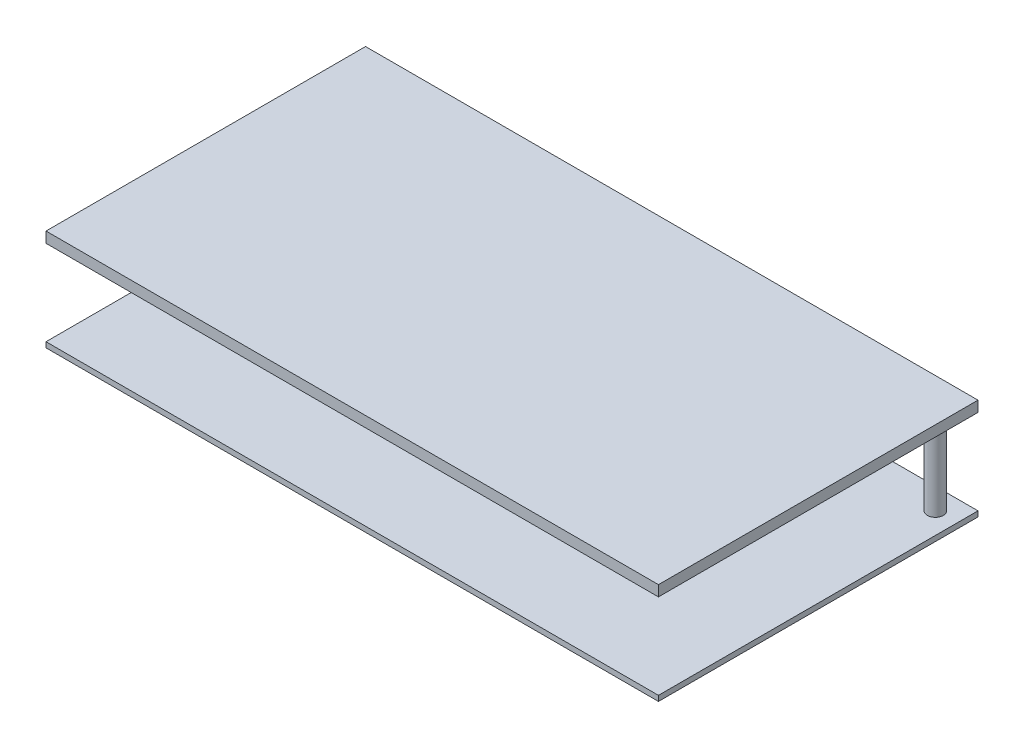
ISO-10303-21;
HEADER;
FILE_DESCRIPTION(('STEP AP214'),'2;1');
FILE_NAME('part.step','',(''),(''),'','','');
FILE_SCHEMA(('AUTOMOTIVE_DESIGN { 1 0 10303 214 1 1 1 1 }'));
ENDSEC;
DATA;
#1=APPLICATION_CONTEXT('core data for automotive mechanical design processes');
#2=APPLICATION_PROTOCOL_DEFINITION('international standard','automotive_design',2000,#1);
#3=PRODUCT_CONTEXT('',#1,'mechanical');
#4=PRODUCT('Part','Part','',(#3));
#5=PRODUCT_RELATED_PRODUCT_CATEGORY('part','',(#4));
#6=PRODUCT_DEFINITION_FORMATION('','',#4);
#7=PRODUCT_DEFINITION_CONTEXT('part definition',#1,'design');
#8=PRODUCT_DEFINITION('design','',#6,#7);
#9=PRODUCT_DEFINITION_SHAPE('','',#8);
#10=(LENGTH_UNIT() NAMED_UNIT(*) SI_UNIT(.MILLI.,.METRE.));
#11=(NAMED_UNIT(*) PLANE_ANGLE_UNIT() SI_UNIT($,.RADIAN.));
#12=(NAMED_UNIT(*) SI_UNIT($,.STERADIAN.) SOLID_ANGLE_UNIT());
#13=UNCERTAINTY_MEASURE_WITH_UNIT(LENGTH_MEASURE(1.E-05),#10,'distance_accuracy_value','');
#14=(GEOMETRIC_REPRESENTATION_CONTEXT(3) GLOBAL_UNCERTAINTY_ASSIGNED_CONTEXT((#13)) GLOBAL_UNIT_ASSIGNED_CONTEXT((#10,
#11,#12)) REPRESENTATION_CONTEXT('',''));
#15=CARTESIAN_POINT('',(0.,0.,0.));
#16=DIRECTION('',(0.,0.,1.));
#17=DIRECTION('',(1.,0.,0.));
#18=AXIS2_PLACEMENT_3D('',#15,#16,#17);
#19=CARTESIAN_POINT('',(-107.062548693336,21.,-7.70824530209498));
#20=DIRECTION('',(0.,0.,1.));
#21=DIRECTION('',(1.,0.,0.));
#22=AXIS2_PLACEMENT_3D('',#19,#20,#21);
#23=PLANE('',#22);
#24=DIRECTION('',(-1.,0.,0.));
#25=VECTOR('',#24,1.);
#26=CARTESIAN_POINT('',(-107.062548693336,19.,-7.70824530209498));
#27=LINE('',#26,#25);
#28=CARTESIAN_POINT('',(-107.062548693336,19.,-7.70824530209498));
#29=VERTEX_POINT('',#28);
#30=CARTESIAN_POINT('',(-222.062548693336,19.,-7.70824530209496));
#31=VERTEX_POINT('',#30);
#32=EDGE_CURVE('E132',#29,#31,#27,.T.);
#33=ORIENTED_EDGE('',*,*,#32,.F.);
#34=DIRECTION('',(0.,-1.,0.));
#35=VECTOR('',#34,1.);
#36=CARTESIAN_POINT('',(-107.062548693336,21.,-7.70824530209498));
#37=LINE('',#36,#35);
#38=CARTESIAN_POINT('',(-107.062548693336,21.,-7.70824530209498));
#39=VERTEX_POINT('',#38);
#40=EDGE_CURVE('E52',#39,#29,#37,.T.);
#41=ORIENTED_EDGE('',*,*,#40,.F.);
#42=DIRECTION('',(-1.,0.,0.));
#43=VECTOR('',#42,1.);
#44=CARTESIAN_POINT('',(-107.062548693336,21.,-7.70824530209498));
#45=LINE('',#44,#43);
#46=CARTESIAN_POINT('',(-222.062548693336,21.,-7.70824530209496));
#47=VERTEX_POINT('',#46);
#48=EDGE_CURVE('E141',#39,#47,#45,.T.);
#49=ORIENTED_EDGE('',*,*,#48,.T.);
#50=DIRECTION('',(0.,-1.,0.));
#51=VECTOR('',#50,1.);
#52=CARTESIAN_POINT('',(-222.062548693336,21.,-7.70824530209496));
#53=LINE('',#52,#51);
#54=EDGE_CURVE('E78',#47,#31,#53,.T.);
#55=ORIENTED_EDGE('',*,*,#54,.T.);
#56=EDGE_LOOP('',(#33,#41,#49,#55));
#57=FACE_BOUND('',#56,.T.);
#58=ADVANCED_FACE('F35',(#57),#23,.T.);
#59=CARTESIAN_POINT('',(-107.062548693336,21.,-7.70824530209498));
#60=DIRECTION('',(-1.,0.,0.));
#61=DIRECTION('',(0.,0.,1.));
#62=AXIS2_PLACEMENT_3D('',#59,#60,#61);
#63=PLANE('',#62);
#64=DIRECTION('',(0.,0.,-1.));
#65=VECTOR('',#64,1.);
#66=CARTESIAN_POINT('',(-107.062548693336,19.,-7.70824530209498));
#67=LINE('',#66,#65);
#68=CARTESIAN_POINT('',(-107.062548693336,19.,-67.708245302095));
#69=VERTEX_POINT('',#68);
#70=EDGE_CURVE('E70',#29,#69,#67,.T.);
#71=ORIENTED_EDGE('',*,*,#70,.T.);
#72=DIRECTION('',(0.,-1.,0.));
#73=VECTOR('',#72,1.);
#74=CARTESIAN_POINT('',(-107.062548693336,21.,-67.708245302095));
#75=LINE('',#74,#73);
#76=CARTESIAN_POINT('',(-107.062548693336,21.,-67.708245302095));
#77=VERTEX_POINT('',#76);
#78=EDGE_CURVE('E157',#77,#69,#75,.T.);
#79=ORIENTED_EDGE('',*,*,#78,.F.);
#80=DIRECTION('',(0.,0.,-1.));
#81=VECTOR('',#80,1.);
#82=CARTESIAN_POINT('',(-107.062548693336,21.,-7.70824530209498));
#83=LINE('',#82,#81);
#84=EDGE_CURVE('E147',#39,#77,#83,.T.);
#85=ORIENTED_EDGE('',*,*,#84,.F.);
#86=ORIENTED_EDGE('',*,*,#40,.T.);
#87=EDGE_LOOP('',(#71,#79,#85,#86));
#88=FACE_BOUND('',#87,.T.);
#89=ADVANCED_FACE('F185',(#88),#63,.F.);
#90=CARTESIAN_POINT('',(-107.062548693336,21.,-67.708245302095));
#91=DIRECTION('',(0.,0.,1.));
#92=DIRECTION('',(1.,0.,0.));
#93=AXIS2_PLACEMENT_3D('',#90,#91,#92);
#94=PLANE('',#93);
#95=DIRECTION('',(-1.,0.,0.));
#96=VECTOR('',#95,1.);
#97=CARTESIAN_POINT('',(-107.062548693336,19.,-67.708245302095));
#98=LINE('',#97,#96);
#99=CARTESIAN_POINT('',(-222.062548693336,19.,-67.708245302095));
#100=VERTEX_POINT('',#99);
#101=EDGE_CURVE('E151',#69,#100,#98,.T.);
#102=ORIENTED_EDGE('',*,*,#101,.T.);
#103=DIRECTION('',(0.,-1.,0.));
#104=VECTOR('',#103,1.);
#105=CARTESIAN_POINT('',(-222.062548693336,21.,-67.708245302095));
#106=LINE('',#105,#104);
#107=CARTESIAN_POINT('',(-222.062548693336,21.,-67.708245302095));
#108=VERTEX_POINT('',#107);
#109=EDGE_CURVE('E159',#108,#100,#106,.T.);
#110=ORIENTED_EDGE('',*,*,#109,.F.);
#111=DIRECTION('',(-1.,0.,0.));
#112=VECTOR('',#111,1.);
#113=CARTESIAN_POINT('',(-107.062548693336,21.,-67.708245302095));
#114=LINE('',#113,#112);
#115=EDGE_CURVE('E145',#77,#108,#114,.T.);
#116=ORIENTED_EDGE('',*,*,#115,.F.);
#117=ORIENTED_EDGE('',*,*,#78,.T.);
#118=EDGE_LOOP('',(#102,#110,#116,#117));
#119=FACE_BOUND('',#118,.T.);
#120=ADVANCED_FACE('F189',(#119),#94,.F.);
#121=CARTESIAN_POINT('',(-222.062548693336,21.,-7.70824530209496));
#122=DIRECTION('',(-1.,0.,0.));
#123=DIRECTION('',(0.,0.,1.));
#124=AXIS2_PLACEMENT_3D('',#121,#122,#123);
#125=PLANE('',#124);
#126=DIRECTION('',(0.,0.,-1.));
#127=VECTOR('',#126,1.);
#128=CARTESIAN_POINT('',(-222.062548693336,19.,-7.70824530209496));
#129=LINE('',#128,#127);
#130=EDGE_CURVE('E135',#31,#100,#129,.T.);
#131=ORIENTED_EDGE('',*,*,#130,.F.);
#132=ORIENTED_EDGE('',*,*,#54,.F.);
#133=DIRECTION('',(0.,0.,-1.));
#134=VECTOR('',#133,1.);
#135=CARTESIAN_POINT('',(-222.062548693336,21.,-7.70824530209496));
#136=LINE('',#135,#134);
#137=EDGE_CURVE('E143',#47,#108,#136,.T.);
#138=ORIENTED_EDGE('',*,*,#137,.T.);
#139=ORIENTED_EDGE('',*,*,#109,.T.);
#140=EDGE_LOOP('',(#131,#132,#138,#139));
#141=FACE_BOUND('',#140,.T.);
#142=ADVANCED_FACE('F199',(#141),#125,.T.);
#143=CARTESIAN_POINT('',(0.,21.,0.));
#144=DIRECTION('',(0.,-1.,0.));
#145=DIRECTION('',(0.,0.,-1.));
#146=AXIS2_PLACEMENT_3D('',#143,#144,#145);
#147=PLANE('',#146);
#148=ORIENTED_EDGE('',*,*,#48,.F.);
#149=ORIENTED_EDGE('',*,*,#84,.T.);
#150=ORIENTED_EDGE('',*,*,#115,.T.);
#151=ORIENTED_EDGE('',*,*,#137,.F.);
#152=EDGE_LOOP('',(#148,#149,#150,#151));
#153=FACE_BOUND('',#152,.T.);
#154=ADVANCED_FACE('F198',(#153),#147,.F.);
#155=CARTESIAN_POINT('',(0.,19.,0.));
#156=DIRECTION('',(0.,-1.,0.));
#157=DIRECTION('',(0.,0.,-1.));
#158=AXIS2_PLACEMENT_3D('',#155,#156,#157);
#159=PLANE('',#158);
#160=CARTESIAN_POINT('',(-192.062548693336,19.,-63.708245302095));
#161=DIRECTION('',(0.,-1.,0.));
#162=DIRECTION('',(0.,0.,-1.));
#163=AXIS2_PLACEMENT_3D('',#160,#161,#162);
#164=CIRCLE('',#163,1.5);
#165=CARTESIAN_POINT('',(-192.062548693336,19.,-65.208245302095));
#166=VERTEX_POINT('',#165);
#167=EDGE_CURVE('E163',#166,#166,#164,.T.);
#168=ORIENTED_EDGE('',*,*,#167,.F.);
#169=EDGE_LOOP('',(#168));
#170=FACE_BOUND('',#169,.T.);
#171=CARTESIAN_POINT('',(-111.062548693336,19.,-63.708245302095));
#172=DIRECTION('',(0.,-1.,0.));
#173=DIRECTION('',(0.,0.,-1.));
#174=AXIS2_PLACEMENT_3D('',#171,#172,#173);
#175=CIRCLE('',#174,1.5);
#176=CARTESIAN_POINT('',(-111.062548693336,19.,-65.208245302095));
#177=VERTEX_POINT('',#176);
#178=EDGE_CURVE('E156',#177,#177,#175,.T.);
#179=ORIENTED_EDGE('',*,*,#178,.F.);
#180=EDGE_LOOP('',(#179));
#181=FACE_BOUND('',#180,.T.);
#182=ORIENTED_EDGE('',*,*,#32,.T.);
#183=ORIENTED_EDGE('',*,*,#130,.T.);
#184=ORIENTED_EDGE('',*,*,#101,.F.);
#185=ORIENTED_EDGE('',*,*,#70,.F.);
#186=EDGE_LOOP('',(#182,#183,#184,#185));
#187=FACE_BOUND('',#186,.T.);
#188=ADVANCED_FACE('F180',(#170,#181,#187),#159,.T.);
#189=CARTESIAN_POINT('',(-111.062548693336,-2.24264068711928,-63.708245302095));
#190=DIRECTION('',(0.,1.,0.));
#191=DIRECTION('',(0.,0.,1.));
#192=AXIS2_PLACEMENT_3D('',#189,#190,#191);
#193=CYLINDRICAL_SURFACE('',#192,1.5);
#194=CARTESIAN_POINT('',(-111.062548693336,3.,-63.708245302095));
#195=DIRECTION('',(0.,1.,0.));
#196=DIRECTION('',(0.,0.,1.));
#197=AXIS2_PLACEMENT_3D('',#194,#195,#196);
#198=CIRCLE('',#197,1.5);
#199=CARTESIAN_POINT('',(-111.062548693336,3.,-62.208245302095));
#200=VERTEX_POINT('',#199);
#201=EDGE_CURVE('E11',#200,#200,#198,.F.);
#202=ORIENTED_EDGE('',*,*,#201,.F.);
#203=EDGE_LOOP('',(#202));
#204=FACE_BOUND('',#203,.T.);
#205=ORIENTED_EDGE('',*,*,#178,.T.);
#206=EDGE_LOOP('',(#205));
#207=FACE_BOUND('',#206,.T.);
#208=ADVANCED_FACE('F173',(#204,#207),#193,.T.);
#209=CARTESIAN_POINT('',(-192.062548693336,-2.24264068711928,-63.708245302095));
#210=DIRECTION('',(0.,1.,0.));
#211=DIRECTION('',(0.,0.,1.));
#212=AXIS2_PLACEMENT_3D('',#209,#210,#211);
#213=CYLINDRICAL_SURFACE('',#212,1.5);
#214=CARTESIAN_POINT('',(-192.062548693336,3.,-63.708245302095));
#215=DIRECTION('',(0.,1.,0.));
#216=DIRECTION('',(0.,0.,1.));
#217=AXIS2_PLACEMENT_3D('',#214,#215,#216);
#218=CIRCLE('',#217,1.5);
#219=CARTESIAN_POINT('',(-192.062548693336,3.,-62.208245302095));
#220=VERTEX_POINT('',#219);
#221=EDGE_CURVE('E38',#220,#220,#218,.F.);
#222=ORIENTED_EDGE('',*,*,#221,.F.);
#223=EDGE_LOOP('',(#222));
#224=FACE_BOUND('',#223,.T.);
#225=ORIENTED_EDGE('',*,*,#167,.T.);
#226=EDGE_LOOP('',(#225));
#227=FACE_BOUND('',#226,.T.);
#228=ADVANCED_FACE('F171',(#224,#227),#213,.T.);
#229=CARTESIAN_POINT('',(-107.062548693336,3.,-7.70824530209498));
#230=DIRECTION('',(-1.,0.,0.));
#231=DIRECTION('',(0.,0.,1.));
#232=AXIS2_PLACEMENT_3D('',#229,#230,#231);
#233=PLANE('',#232);
#234=DIRECTION('',(0.,0.,-1.));
#235=VECTOR('',#234,1.);
#236=CARTESIAN_POINT('',(-107.062548693336,2.,-7.70824530209498));
#237=LINE('',#236,#235);
#238=CARTESIAN_POINT('',(-107.062548693336,2.,-7.70824530209498));
#239=VERTEX_POINT('',#238);
#240=CARTESIAN_POINT('',(-107.062548693336,2.,-67.708245302095));
#241=VERTEX_POINT('',#240);
#242=EDGE_CURVE('E131',#239,#241,#237,.T.);
#243=ORIENTED_EDGE('',*,*,#242,.T.);
#244=DIRECTION('',(0.,-1.,0.));
#245=VECTOR('',#244,1.);
#246=CARTESIAN_POINT('',(-107.062548693336,3.,-67.708245302095));
#247=LINE('',#246,#245);
#248=CARTESIAN_POINT('',(-107.062548693336,3.,-67.708245302095));
#249=VERTEX_POINT('',#248);
#250=EDGE_CURVE('E111',#249,#241,#247,.T.);
#251=ORIENTED_EDGE('',*,*,#250,.F.);
#252=DIRECTION('',(0.,0.,-1.));
#253=VECTOR('',#252,1.);
#254=CARTESIAN_POINT('',(-107.062548693336,3.,-7.70824530209498));
#255=LINE('',#254,#253);
#256=CARTESIAN_POINT('',(-107.062548693336,3.,-7.70824530209498));
#257=VERTEX_POINT('',#256);
#258=EDGE_CURVE('E118',#257,#249,#255,.T.);
#259=ORIENTED_EDGE('',*,*,#258,.F.);
#260=DIRECTION('',(0.,-1.,0.));
#261=VECTOR('',#260,1.);
#262=CARTESIAN_POINT('',(-107.062548693336,3.,-7.70824530209498));
#263=LINE('',#262,#261);
#264=EDGE_CURVE('E230',#257,#239,#263,.T.);
#265=ORIENTED_EDGE('',*,*,#264,.T.);
#266=EDGE_LOOP('',(#243,#251,#259,#265));
#267=FACE_BOUND('',#266,.T.);
#268=ADVANCED_FACE('F129',(#267),#233,.F.);
#269=CARTESIAN_POINT('',(-107.062548693336,3.,-67.708245302095));
#270=DIRECTION('',(0.,0.,1.));
#271=DIRECTION('',(1.,0.,0.));
#272=AXIS2_PLACEMENT_3D('',#269,#270,#271);
#273=PLANE('',#272);
#274=DIRECTION('',(-1.,0.,0.));
#275=VECTOR('',#274,1.);
#276=CARTESIAN_POINT('',(-107.062548693336,2.,-67.708245302095));
#277=LINE('',#276,#275);
#278=CARTESIAN_POINT('',(-222.062548693336,2.,-67.708245302095));
#279=VERTEX_POINT('',#278);
#280=EDGE_CURVE('E221',#241,#279,#277,.T.);
#281=ORIENTED_EDGE('',*,*,#280,.T.);
#282=DIRECTION('',(0.,-1.,0.));
#283=VECTOR('',#282,1.);
#284=CARTESIAN_POINT('',(-222.062548693336,3.,-67.708245302095));
#285=LINE('',#284,#283);
#286=CARTESIAN_POINT('',(-222.062548693336,3.,-67.708245302095));
#287=VERTEX_POINT('',#286);
#288=EDGE_CURVE('E114',#287,#279,#285,.T.);
#289=ORIENTED_EDGE('',*,*,#288,.F.);
#290=DIRECTION('',(-1.,0.,0.));
#291=VECTOR('',#290,1.);
#292=CARTESIAN_POINT('',(-107.062548693336,3.,-67.708245302095));
#293=LINE('',#292,#291);
#294=EDGE_CURVE('E107',#249,#287,#293,.T.);
#295=ORIENTED_EDGE('',*,*,#294,.F.);
#296=ORIENTED_EDGE('',*,*,#250,.T.);
#297=EDGE_LOOP('',(#281,#289,#295,#296));
#298=FACE_BOUND('',#297,.T.);
#299=ADVANCED_FACE('F109',(#298),#273,.F.);
#300=CARTESIAN_POINT('',(-222.062548693336,3.,-7.70824530209496));
#301=DIRECTION('',(1.,0.,0.));
#302=DIRECTION('',(0.,0.,-1.));
#303=AXIS2_PLACEMENT_3D('',#300,#301,#302);
#304=PLANE('',#303);
#305=DIRECTION('',(0.,0.,1.));
#306=VECTOR('',#305,1.);
#307=CARTESIAN_POINT('',(-222.062548693336,2.,-7.70824530209496));
#308=LINE('',#307,#306);
#309=CARTESIAN_POINT('',(-222.062548693336,2.,-7.70824530209496));
#310=VERTEX_POINT('',#309);
#311=EDGE_CURVE('E223',#279,#310,#308,.T.);
#312=ORIENTED_EDGE('',*,*,#311,.T.);
#313=DIRECTION('',(0.,-1.,0.));
#314=VECTOR('',#313,1.);
#315=CARTESIAN_POINT('',(-222.062548693336,3.,-7.70824530209496));
#316=LINE('',#315,#314);
#317=CARTESIAN_POINT('',(-222.062548693336,3.,-7.70824530209496));
#318=VERTEX_POINT('',#317);
#319=EDGE_CURVE('E137',#318,#310,#316,.T.);
#320=ORIENTED_EDGE('',*,*,#319,.F.);
#321=DIRECTION('',(0.,0.,1.));
#322=VECTOR('',#321,1.);
#323=CARTESIAN_POINT('',(-222.062548693336,3.,-7.70824530209496));
#324=LINE('',#323,#322);
#325=EDGE_CURVE('E117',#287,#318,#324,.T.);
#326=ORIENTED_EDGE('',*,*,#325,.F.);
#327=ORIENTED_EDGE('',*,*,#288,.T.);
#328=EDGE_LOOP('',(#312,#320,#326,#327));
#329=FACE_BOUND('',#328,.T.);
#330=ADVANCED_FACE('F235',(#329),#304,.F.);
#331=CARTESIAN_POINT('',(-107.062548693336,3.,-7.70824530209498));
#332=DIRECTION('',(0.,0.,-1.));
#333=DIRECTION('',(-1.,0.,0.));
#334=AXIS2_PLACEMENT_3D('',#331,#332,#333);
#335=PLANE('',#334);
#336=DIRECTION('',(1.,0.,0.));
#337=VECTOR('',#336,1.);
#338=CARTESIAN_POINT('',(-107.062548693336,2.,-7.70824530209498));
#339=LINE('',#338,#337);
#340=EDGE_CURVE('E127',#310,#239,#339,.T.);
#341=ORIENTED_EDGE('',*,*,#340,.T.);
#342=ORIENTED_EDGE('',*,*,#264,.F.);
#343=DIRECTION('',(1.,0.,0.));
#344=VECTOR('',#343,1.);
#345=CARTESIAN_POINT('',(-107.062548693336,3.,-7.70824530209498));
#346=LINE('',#345,#344);
#347=EDGE_CURVE('E123',#318,#257,#346,.T.);
#348=ORIENTED_EDGE('',*,*,#347,.F.);
#349=ORIENTED_EDGE('',*,*,#319,.T.);
#350=EDGE_LOOP('',(#341,#342,#348,#349));
#351=FACE_BOUND('',#350,.T.);
#352=ADVANCED_FACE('F216',(#351),#335,.F.);
#353=CARTESIAN_POINT('',(0.,3.,0.));
#354=DIRECTION('',(0.,1.,0.));
#355=DIRECTION('',(0.,0.,1.));
#356=AXIS2_PLACEMENT_3D('',#353,#354,#355);
#357=PLANE('',#356);
#358=ORIENTED_EDGE('',*,*,#201,.T.);
#359=EDGE_LOOP('',(#358));
#360=FACE_BOUND('',#359,.T.);
#361=ORIENTED_EDGE('',*,*,#221,.T.);
#362=EDGE_LOOP('',(#361));
#363=FACE_BOUND('',#362,.T.);
#364=ORIENTED_EDGE('',*,*,#258,.T.);
#365=ORIENTED_EDGE('',*,*,#294,.T.);
#366=ORIENTED_EDGE('',*,*,#325,.T.);
#367=ORIENTED_EDGE('',*,*,#347,.T.);
#368=EDGE_LOOP('',(#364,#365,#366,#367));
#369=FACE_BOUND('',#368,.T.);
#370=ADVANCED_FACE('F121',(#360,#363,#369),#357,.T.);
#371=CARTESIAN_POINT('',(-158.756257495171,2.,-128.708245302289));
#372=DIRECTION('',(0.,-1.,0.));
#373=DIRECTION('',(0.,0.,-1.));
#374=AXIS2_PLACEMENT_3D('',#371,#372,#373);
#375=PLANE('',#374);
#376=ORIENTED_EDGE('',*,*,#242,.F.);
#377=ORIENTED_EDGE('',*,*,#340,.F.);
#378=ORIENTED_EDGE('',*,*,#311,.F.);
#379=ORIENTED_EDGE('',*,*,#280,.F.);
#380=EDGE_LOOP('',(#376,#377,#378,#379));
#381=FACE_BOUND('',#380,.T.);
#382=ADVANCED_FACE('F210',(#381),#375,.T.);
#383=CLOSED_SHELL('',(#58,#89,#120,#142,#154,#188,#208,#228,#268,#299,#330,#352,#370,#382));
#384=MANIFOLD_SOLID_BREP('B2',#383);
#385=ADVANCED_BREP_SHAPE_REPRESENTATION('',(#18,#384),#14);
#386=SHAPE_DEFINITION_REPRESENTATION(#9,#385);
ENDSEC;
END-ISO-10303-21;
